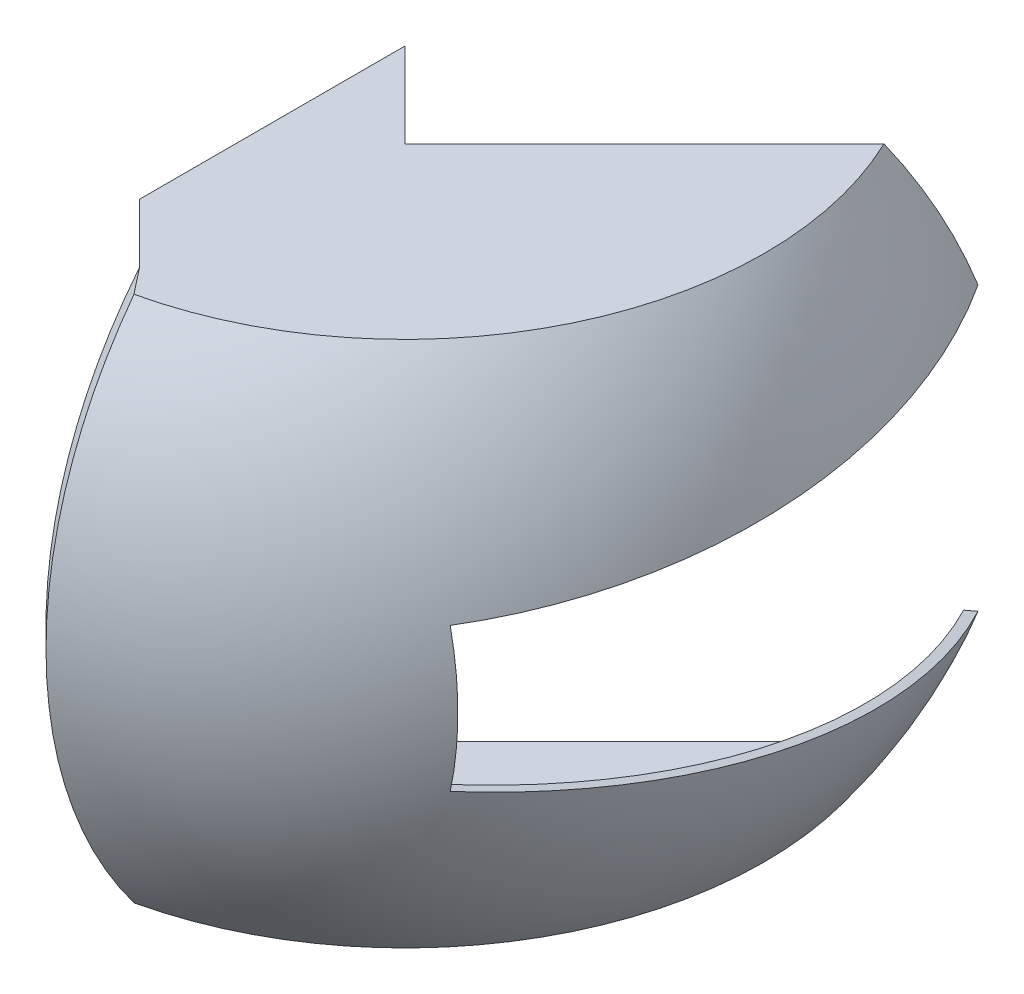
ISO-10303-21;
HEADER;
FILE_DESCRIPTION(('STEP AP214'),'2;1');
FILE_NAME('part.step','',(''),(''),'','','');
FILE_SCHEMA(('AUTOMOTIVE_DESIGN { 1 0 10303 214 1 1 1 1 }'));
ENDSEC;
DATA;
#1=APPLICATION_CONTEXT('core data for automotive mechanical design processes');
#2=APPLICATION_PROTOCOL_DEFINITION('international standard','automotive_design',2000,#1);
#3=PRODUCT_CONTEXT('',#1,'mechanical');
#4=PRODUCT('Part','Part','',(#3));
#5=PRODUCT_RELATED_PRODUCT_CATEGORY('part','',(#4));
#6=PRODUCT_DEFINITION_FORMATION('','',#4);
#7=PRODUCT_DEFINITION_CONTEXT('part definition',#1,'design');
#8=PRODUCT_DEFINITION('design','',#6,#7);
#9=PRODUCT_DEFINITION_SHAPE('','',#8);
#10=(LENGTH_UNIT() NAMED_UNIT(*) SI_UNIT(.MILLI.,.METRE.));
#11=(NAMED_UNIT(*) PLANE_ANGLE_UNIT() SI_UNIT($,.RADIAN.));
#12=(NAMED_UNIT(*) SI_UNIT($,.STERADIAN.) SOLID_ANGLE_UNIT());
#13=UNCERTAINTY_MEASURE_WITH_UNIT(LENGTH_MEASURE(1.E-05),#10,'distance_accuracy_value','');
#14=(GEOMETRIC_REPRESENTATION_CONTEXT(3) GLOBAL_UNCERTAINTY_ASSIGNED_CONTEXT((#13)) GLOBAL_UNIT_ASSIGNED_CONTEXT((#10,
#11,#12)) REPRESENTATION_CONTEXT('',''));
#15=CARTESIAN_POINT('',(0.,0.,0.));
#16=DIRECTION('',(0.,0.,1.));
#17=DIRECTION('',(1.,0.,0.));
#18=AXIS2_PLACEMENT_3D('',#15,#16,#17);
#19=CARTESIAN_POINT('',(12.2872806643349,55.,48.6036465452657));
#20=DIRECTION('',(1.,0.,0.));
#21=DIRECTION('',(0.,0.,-1.));
#22=AXIS2_PLACEMENT_3D('',#19,#20,#21);
#23=PLANE('',#22);
#24=DIRECTION('',(0.,1.,0.));
#25=VECTOR('',#24,1.);
#26=CARTESIAN_POINT('',(12.2872806643349,53.,67.6544254972796));
#27=LINE('',#26,#25);
#28=CARTESIAN_POINT('',(12.2872806643349,53.,67.6544254972796));
#29=VERTEX_POINT('',#28);
#30=CARTESIAN_POINT('',(12.2872806643349,55.,67.6544254972796));
#31=VERTEX_POINT('',#30);
#32=EDGE_CURVE('E61',#29,#31,#27,.T.);
#33=ORIENTED_EDGE('',*,*,#32,.F.);
#34=DIRECTION('',(0.,0.,1.));
#35=VECTOR('',#34,1.);
#36=CARTESIAN_POINT('',(12.2872806643349,53.,48.6036465452657));
#37=LINE('',#36,#35);
#38=CARTESIAN_POINT('',(12.2872806643349,53.,65.6345895867117));
#39=VERTEX_POINT('',#38);
#40=EDGE_CURVE('E181',#39,#29,#37,.T.);
#41=ORIENTED_EDGE('',*,*,#40,.F.);
#42=CARTESIAN_POINT('',(12.2872806643349,0.,0.));
#43=DIRECTION('',(1.,0.,0.));
#44=DIRECTION('',(0.,0.,-1.));
#45=AXIS2_PLACEMENT_3D('',#42,#43,#44);
#46=CIRCLE('',#45,84.3617173261432);
#47=CARTESIAN_POINT('',(12.2872806643349,-53.,65.6345895867118));
#48=VERTEX_POINT('',#47);
#49=EDGE_CURVE('E226',#48,#39,#46,.F.);
#50=ORIENTED_EDGE('',*,*,#49,.F.);
#51=DIRECTION('',(0.,0.,1.));
#52=VECTOR('',#51,1.);
#53=CARTESIAN_POINT('',(12.2872806643349,-53.,48.6036465452657));
#54=LINE('',#53,#52);
#55=CARTESIAN_POINT('',(12.2872806643349,-53.,67.6544254972796));
#56=VERTEX_POINT('',#55);
#57=EDGE_CURVE('E196',#48,#56,#54,.T.);
#58=ORIENTED_EDGE('',*,*,#57,.T.);
#59=DIRECTION('',(0.,-1.,0.));
#60=VECTOR('',#59,1.);
#61=CARTESIAN_POINT('',(12.2872806643349,-53.,67.6544254972796));
#62=LINE('',#61,#60);
#63=CARTESIAN_POINT('',(12.2872806643349,-55.,67.6544254972796));
#64=VERTEX_POINT('',#63);
#65=EDGE_CURVE('E204',#56,#64,#62,.T.);
#66=ORIENTED_EDGE('',*,*,#65,.T.);
#67=CARTESIAN_POINT('',(12.2872806643349,0.,0.));
#68=DIRECTION('',(1.,0.,0.));
#69=DIRECTION('',(0.,0.,-1.));
#70=AXIS2_PLACEMENT_3D('',#67,#68,#69);
#71=CIRCLE('',#70,87.1901444508894);
#72=EDGE_CURVE('E54',#64,#31,#71,.F.);
#73=ORIENTED_EDGE('',*,*,#72,.T.);
#74=EDGE_LOOP('',(#33,#41,#50,#58,#66,#73));
#75=FACE_BOUND('',#74,.T.);
#76=ADVANCED_FACE('F39',(#75),#23,.F.);
#77=CARTESIAN_POINT('',(0.,0.,0.));
#78=DIRECTION('',(-1.,0.,0.));
#79=DIRECTION('',(0.,0.,1.));
#80=AXIS2_PLACEMENT_3D('',#77,#78,#79);
#81=PLANE('',#80);
#82=DIRECTION('',(0.,0.,-1.));
#83=VECTOR('',#82,1.);
#84=CARTESIAN_POINT('',(0.,-55.,0.));
#85=LINE('',#84,#83);
#86=CARTESIAN_POINT('',(0.,-55.,55.3671448329446));
#87=VERTEX_POINT('',#86);
#88=CARTESIAN_POINT('',(0.,-55.,0.));
#89=VERTEX_POINT('',#88);
#90=EDGE_CURVE('E344',#87,#89,#85,.T.);
#91=ORIENTED_EDGE('',*,*,#90,.F.);
#92=DIRECTION('',(0.,-1.,0.));
#93=VECTOR('',#92,1.);
#94=CARTESIAN_POINT('',(0.,-53.,55.3671448329446));
#95=LINE('',#94,#93);
#96=CARTESIAN_POINT('',(0.,-53.,55.3671448329446));
#97=VERTEX_POINT('',#96);
#98=EDGE_CURVE('E208',#97,#87,#95,.T.);
#99=ORIENTED_EDGE('',*,*,#98,.F.);
#100=DIRECTION('',(0.,0.,-1.));
#101=VECTOR('',#100,1.);
#102=CARTESIAN_POINT('',(0.,-53.,0.));
#103=LINE('',#102,#101);
#104=CARTESIAN_POINT('',(0.,-53.,0.));
#105=VERTEX_POINT('',#104);
#106=EDGE_CURVE('E174',#97,#105,#103,.T.);
#107=ORIENTED_EDGE('',*,*,#106,.T.);
#108=DIRECTION('',(0.,-1.,0.));
#109=VECTOR('',#108,1.);
#110=CARTESIAN_POINT('',(0.,55.,0.));
#111=LINE('',#110,#109);
#112=EDGE_CURVE('E322',#105,#89,#111,.T.);
#113=ORIENTED_EDGE('',*,*,#112,.T.);
#114=EDGE_LOOP('',(#91,#99,#107,#113));
#115=FACE_BOUND('',#114,.T.);
#116=ADVANCED_FACE('F385',(#115),#81,.T.);
#117=CARTESIAN_POINT('',(0.,55.,0.));
#118=DIRECTION('',(-0.707106781186547,0.,0.707106781186547));
#119=DIRECTION('',(0.707106781186548,0.,0.707106781186548));
#120=AXIS2_PLACEMENT_3D('',#117,#118,#119);
#121=PLANE('',#120);
#122=DIRECTION('',(-0.707106781186548,0.,-0.707106781186548));
#123=VECTOR('',#122,1.);
#124=CARTESIAN_POINT('',(0.,-53.,0.));
#125=LINE('',#124,#123);
#126=CARTESIAN_POINT('',(17.6776695296637,-53.,17.6776695296637));
#127=VERTEX_POINT('',#126);
#128=EDGE_CURVE('E272',#127,#105,#125,.T.);
#129=ORIENTED_EDGE('',*,*,#128,.F.);
#130=DIRECTION('',(0.,-1.,0.));
#131=VECTOR('',#130,1.);
#132=CARTESIAN_POINT('',(17.6776695296637,55.,17.6776695296637));
#133=LINE('',#132,#131);
#134=CARTESIAN_POINT('',(17.6776695296637,-55.,17.6776695296637));
#135=VERTEX_POINT('',#134);
#136=EDGE_CURVE('E334',#127,#135,#133,.T.);
#137=ORIENTED_EDGE('',*,*,#136,.T.);
#138=DIRECTION('',(-0.707106781186547,0.,-0.707106781186547));
#139=VECTOR('',#138,1.);
#140=CARTESIAN_POINT('',(0.,-55.,0.));
#141=LINE('',#140,#139);
#142=EDGE_CURVE('E312',#135,#89,#141,.T.);
#143=ORIENTED_EDGE('',*,*,#142,.T.);
#144=ORIENTED_EDGE('',*,*,#112,.F.);
#145=EDGE_LOOP('',(#129,#137,#143,#144));
#146=FACE_BOUND('',#145,.T.);
#147=ADVANCED_FACE('F390',(#146),#121,.F.);
#148=DIRECTION('',(0.,0.,-1.));
#149=VECTOR('',#148,1.);
#150=CARTESIAN_POINT('',(0.,53.,0.));
#151=LINE('',#150,#149);
#152=CARTESIAN_POINT('',(0.,53.,55.3671448329446));
#153=VERTEX_POINT('',#152);
#154=CARTESIAN_POINT('',(0.,53.,0.));
#155=VERTEX_POINT('',#154);
#156=EDGE_CURVE('E164',#153,#155,#151,.T.);
#157=ORIENTED_EDGE('',*,*,#156,.F.);
#158=DIRECTION('',(0.,1.,0.));
#159=VECTOR('',#158,1.);
#160=CARTESIAN_POINT('',(0.,53.,55.3671448329446));
#161=LINE('',#160,#159);
#162=CARTESIAN_POINT('',(0.,55.,55.3671448329446));
#163=VERTEX_POINT('',#162);
#164=EDGE_CURVE('E169',#153,#163,#161,.T.);
#165=ORIENTED_EDGE('',*,*,#164,.T.);
#166=DIRECTION('',(0.,0.,-1.));
#167=VECTOR('',#166,1.);
#168=CARTESIAN_POINT('',(0.,55.,0.));
#169=LINE('',#168,#167);
#170=CARTESIAN_POINT('',(0.,55.,0.));
#171=VERTEX_POINT('',#170);
#172=EDGE_CURVE('E341',#163,#171,#169,.T.);
#173=ORIENTED_EDGE('',*,*,#172,.T.);
#174=EDGE_CURVE('E170',#171,#155,#111,.T.);
#175=ORIENTED_EDGE('',*,*,#174,.T.);
#176=EDGE_LOOP('',(#157,#165,#173,#175));
#177=FACE_BOUND('',#176,.T.);
#178=ADVANCED_FACE('F166',(#177),#81,.T.);
#179=CARTESIAN_POINT('',(17.6776695296637,55.,17.6776695296637));
#180=DIRECTION('',(0.707106781186548,0.,0.707106781186548));
#181=DIRECTION('',(0.707106781186548,0.,-0.707106781186548));
#182=AXIS2_PLACEMENT_3D('',#179,#180,#181);
#183=PLANE('',#182);
#184=DIRECTION('',(-0.703571165799069,-0.0998760697678762,0.703571165799069));
#185=VECTOR('',#184,1.);
#186=CARTESIAN_POINT('',(20.0662914918726,21.3469829657806,15.2890475674547));
#187=LINE('',#186,#185);
#188=CARTESIAN_POINT('',(77.4891998766671,29.4985029297923,-42.1338608173398));
#189=VERTEX_POINT('',#188);
#190=CARTESIAN_POINT('',(75.9845002304108,29.2849019550017,-40.6291611710834));
#191=VERTEX_POINT('',#190);
#192=EDGE_CURVE('E300',#189,#191,#187,.T.);
#193=ORIENTED_EDGE('',*,*,#192,.T.);
#194=CARTESIAN_POINT('',(17.6776695296637,0.,17.6776695296637));
#195=DIRECTION('',(0.707106781186548,0.,0.707106781186548));
#196=DIRECTION('',(0.707106781186548,0.,-0.707106781186548));
#197=AXIS2_PLACEMENT_3D('',#194,#195,#196);
#198=CIRCLE('',#197,87.5041627309537);
#199=CARTESIAN_POINT('',(66.9116948335388,53.,-31.5563557742114));
#200=VERTEX_POINT('',#199);
#201=EDGE_CURVE('E262',#191,#200,#198,.T.);
#202=ORIENTED_EDGE('',*,*,#201,.T.);
#203=DIRECTION('',(-0.707106781186548,0.,0.707106781186548));
#204=VECTOR('',#203,1.);
#205=CARTESIAN_POINT('',(17.6776695296637,53.,17.6776695296637));
#206=LINE('',#205,#204);
#207=CARTESIAN_POINT('',(17.6776695296637,53.,17.6776695296637));
#208=VERTEX_POINT('',#207);
#209=EDGE_CURVE('E257',#200,#208,#206,.T.);
#210=ORIENTED_EDGE('',*,*,#209,.T.);
#211=CARTESIAN_POINT('',(17.6776695296637,55.,17.6776695296637));
#212=VERTEX_POINT('',#211);
#213=EDGE_CURVE('E329',#212,#208,#133,.T.);
#214=ORIENTED_EDGE('',*,*,#213,.F.);
#215=DIRECTION('',(-0.707106781186548,0.,0.707106781186548));
#216=VECTOR('',#215,1.);
#217=CARTESIAN_POINT('',(17.6776695296637,55.,17.6776695296637));
#218=LINE('',#217,#216);
#219=CARTESIAN_POINT('',(67.6776695296637,55.,-32.3223304703363));
#220=VERTEX_POINT('',#219);
#221=EDGE_CURVE('E317',#220,#212,#218,.T.);
#222=ORIENTED_EDGE('',*,*,#221,.F.);
#223=CARTESIAN_POINT('',(17.6776695296637,0.,17.6776695296637));
#224=DIRECTION('',(0.707106781186548,0.,0.707106781186548));
#225=DIRECTION('',(0.707106781186548,0.,-0.707106781186548));
#226=AXIS2_PLACEMENT_3D('',#223,#224,#225);
#227=CIRCLE('',#226,89.5823643358446);
#228=EDGE_CURVE('E333',#189,#220,#227,.T.);
#229=ORIENTED_EDGE('',*,*,#228,.F.);
#230=EDGE_LOOP('',(#193,#202,#210,#214,#222,#229));
#231=FACE_BOUND('',#230,.T.);
#232=ADVANCED_FACE('F400',(#231),#183,.F.);
#233=ORIENTED_EDGE('',*,*,#213,.T.);
#234=DIRECTION('',(-0.707106781186548,0.,-0.707106781186548));
#235=VECTOR('',#234,1.);
#236=CARTESIAN_POINT('',(0.,53.,0.));
#237=LINE('',#236,#235);
#238=EDGE_CURVE('E254',#208,#155,#237,.T.);
#239=ORIENTED_EDGE('',*,*,#238,.T.);
#240=ORIENTED_EDGE('',*,*,#174,.F.);
#241=DIRECTION('',(-0.707106781186547,0.,-0.707106781186547));
#242=VECTOR('',#241,1.);
#243=CARTESIAN_POINT('',(0.,55.,0.));
#244=LINE('',#243,#242);
#245=EDGE_CURVE('E313',#212,#171,#244,.T.);
#246=ORIENTED_EDGE('',*,*,#245,.F.);
#247=EDGE_LOOP('',(#233,#239,#240,#246));
#248=FACE_BOUND('',#247,.T.);
#249=ADVANCED_FACE('F382',(#248),#121,.F.);
#250=CARTESIAN_POINT('',(0.,55.,0.));
#251=DIRECTION('',(0.,-1.,0.));
#252=DIRECTION('',(0.,0.,-1.));
#253=AXIS2_PLACEMENT_3D('',#250,#251,#252);
#254=PLANE('',#253);
#255=DIRECTION('',(-0.707106781186544,0.,-0.707106781186551));
#256=VECTOR('',#255,1.);
#257=CARTESIAN_POINT('',(12.2872806643349,55.,67.6544254972796));
#258=LINE('',#257,#256);
#259=EDGE_CURVE('E188',#31,#163,#258,.T.);
#260=ORIENTED_EDGE('',*,*,#259,.F.);
#261=CARTESIAN_POINT('',(12.2872806643349,55.,67.6544254972796));
#262=CARTESIAN_POINT('',(12.6439303032145,55.,68.1140587831876));
#263=CARTESIAN_POINT('',(13.0014808741294,55.,68.5729925023131));
#264=CARTESIAN_POINT('',(13.7182975260488,55.,69.4895087756792));
#265=CARTESIAN_POINT('',(14.077563584871,55.,69.9470913472678));
#266=CARTESIAN_POINT('',(14.7977337330616,55.,70.8609647294817));
#267=CARTESIAN_POINT('',(15.158637820936,55.,71.3172555412845));
#268=CARTESIAN_POINT('',(15.8820145741686,55.,72.2286017574101));
#269=CARTESIAN_POINT('',(16.2444872596942,55.,72.683657145726));
#270=CARTESIAN_POINT('',(16.6077046993767,55.,73.1381169064278));
#271=B_SPLINE_CURVE_WITH_KNOTS('',3,(#261,#262,#263,#264,#265,#266,#267,#268,#269,#270),
.UNSPECIFIED.,.F.,.F.,(4,2,2,2,4),(0.,1.74532221552484,3.49062192368656,5.23592004032604,
6.98124066332975),.UNSPECIFIED.);
#272=CARTESIAN_POINT('',(16.6077046993767,55.,73.1381169064278));
#273=VERTEX_POINT('',#272);
#274=EDGE_CURVE('E11',#31,#273,#271,.T.);
#275=ORIENTED_EDGE('',*,*,#274,.T.);
#276=CARTESIAN_POINT('',(0.,55.,0.));
#277=DIRECTION('',(0.,-1.,0.));
#278=DIRECTION('',(0.,0.,-1.));
#279=AXIS2_PLACEMENT_3D('',#276,#277,#278);
#280=CIRCLE('',#279,75.);
#281=EDGE_CURVE('E352',#220,#273,#280,.T.);
#282=ORIENTED_EDGE('',*,*,#281,.F.);
#283=ORIENTED_EDGE('',*,*,#221,.T.);
#284=ORIENTED_EDGE('',*,*,#245,.T.);
#285=ORIENTED_EDGE('',*,*,#172,.F.);
#286=EDGE_LOOP('',(#260,#275,#282,#283,#284,#285));
#287=FACE_BOUND('',#286,.T.);
#288=ADVANCED_FACE('F374',(#287),#254,.F.);
#289=CARTESIAN_POINT('',(0.,0.,0.));
#290=DIRECTION('',(0.,-1.,0.));
#291=DIRECTION('',(0.,0.,-1.));
#292=AXIS2_PLACEMENT_3D('',#289,#290,#291);
#293=SPHERICAL_SURFACE('',#292,93.0053761886914);
#294=ORIENTED_EDGE('',*,*,#281,.T.);
#295=CARTESIAN_POINT('',(16.6077046993767,0.,0.));
#296=DIRECTION('',(-1.,0.,0.));
#297=DIRECTION('',(0.,0.,1.));
#298=AXIS2_PLACEMENT_3D('',#295,#296,#297);
#299=CIRCLE('',#298,91.5105684859312);
#300=CARTESIAN_POINT('',(16.6077046993767,-55.,73.1381169064278));
#301=VERTEX_POINT('',#300);
#302=EDGE_CURVE('E356',#273,#301,#299,.F.);
#303=ORIENTED_EDGE('',*,*,#302,.T.);
#304=CARTESIAN_POINT('',(0.,-55.,0.));
#305=DIRECTION('',(0.,-1.,0.));
#306=DIRECTION('',(0.,0.,-1.));
#307=AXIS2_PLACEMENT_3D('',#304,#305,#306);
#308=CIRCLE('',#307,75.);
#309=CARTESIAN_POINT('',(67.6776695296637,-55.,-32.3223304703363));
#310=VERTEX_POINT('',#309);
#311=EDGE_CURVE('E348',#310,#301,#308,.T.);
#312=ORIENTED_EDGE('',*,*,#311,.F.);
#313=CARTESIAN_POINT('',(77.4891998766672,-29.4985029297923,-42.1338608173398));
#314=VERTEX_POINT('',#313);
#315=EDGE_CURVE('E337',#310,#314,#227,.T.);
#316=ORIENTED_EDGE('',*,*,#315,.T.);
#317=CARTESIAN_POINT('',(0.,-23.0528052823745,3.27248144985129));
#318=DIRECTION('',(0.,-0.990074030670294,0.140546838428607));
#319=DIRECTION('',(0.,-0.140546838428607,-0.990074030670294));
#320=AXIS2_PLACEMENT_3D('',#317,#318,#319);
#321=CIRCLE('',#320,90.0436507132696);
#322=CARTESIAN_POINT('',(69.462219947249,-15.,60.));
#323=VERTEX_POINT('',#322);
#324=EDGE_CURVE('E296',#314,#323,#321,.T.);
#325=ORIENTED_EDGE('',*,*,#324,.T.);
#326=CARTESIAN_POINT('',(0.,0.,60.));
#327=DIRECTION('',(0.,0.,1.));
#328=DIRECTION('',(1.,0.,0.));
#329=AXIS2_PLACEMENT_3D('',#326,#327,#328);
#330=CIRCLE('',#329,71.0633520177595);
#331=CARTESIAN_POINT('',(69.462219947249,15.,60.));
#332=VERTEX_POINT('',#331);
#333=EDGE_CURVE('E308',#323,#332,#330,.T.);
#334=ORIENTED_EDGE('',*,*,#333,.T.);
#335=CARTESIAN_POINT('',(0.,23.0528052823745,3.27248144985129));
#336=DIRECTION('',(0.,0.990074030670294,0.140546838428607));
#337=DIRECTION('',(0.,-0.140546838428607,0.990074030670294));
#338=AXIS2_PLACEMENT_3D('',#335,#336,#337);
#339=CIRCLE('',#338,90.0436507132696);
#340=EDGE_CURVE('E304',#332,#189,#339,.T.);
#341=ORIENTED_EDGE('',*,*,#340,.T.);
#342=ORIENTED_EDGE('',*,*,#228,.T.);
#343=EDGE_LOOP('',(#294,#303,#312,#316,#325,#334,#341,#342));
#344=FACE_BOUND('',#343,.T.);
#345=ADVANCED_FACE('F372',(#344),#293,.T.);
#346=CARTESIAN_POINT('',(0.,-55.,0.));
#347=DIRECTION('',(0.,-1.,0.));
#348=DIRECTION('',(0.,0.,-1.));
#349=AXIS2_PLACEMENT_3D('',#346,#347,#348);
#350=PLANE('',#349);
#351=CARTESIAN_POINT('',(16.6077046993767,-55.,73.1381169064278));
#352=CARTESIAN_POINT('',(16.2444872596942,-55.,72.683657145726));
#353=CARTESIAN_POINT('',(15.8820145741686,-55.,72.2286017574101));
#354=CARTESIAN_POINT('',(15.158637820936,-55.,71.3172555412845));
#355=CARTESIAN_POINT('',(14.7977337330615,-55.,70.8609647294816));
#356=CARTESIAN_POINT('',(14.077563584871,-55.,69.9470913472678));
#357=CARTESIAN_POINT('',(13.7182975260488,-55.,69.4895087756791));
#358=CARTESIAN_POINT('',(13.0014808741294,-55.,68.5729925023131));
#359=CARTESIAN_POINT('',(12.6439303032145,-55.,68.1140587831876));
#360=CARTESIAN_POINT('',(12.2872806643349,-55.,67.6544254972796));
#361=B_SPLINE_CURVE_WITH_KNOTS('',3,(#351,#352,#353,#354,#355,#356,#357,#358,#359,#360),
.UNSPECIFIED.,.F.,.F.,(4,2,2,2,4),(0.,1.74532062300368,3.4906187396432,5.2359184478049,
6.98124066332975),.UNSPECIFIED.);
#362=EDGE_CURVE('E360',#301,#64,#361,.T.);
#363=ORIENTED_EDGE('',*,*,#362,.T.);
#364=DIRECTION('',(-0.707106781186544,0.,-0.707106781186551));
#365=VECTOR('',#364,1.);
#366=CARTESIAN_POINT('',(12.2872806643349,-55.,67.6544254972796));
#367=LINE('',#366,#365);
#368=EDGE_CURVE('E192',#64,#87,#367,.T.);
#369=ORIENTED_EDGE('',*,*,#368,.T.);
#370=ORIENTED_EDGE('',*,*,#90,.T.);
#371=ORIENTED_EDGE('',*,*,#142,.F.);
#372=DIRECTION('',(-0.707106781186548,0.,0.707106781186548));
#373=VECTOR('',#372,1.);
#374=CARTESIAN_POINT('',(17.6776695296637,-55.,17.6776695296637));
#375=LINE('',#374,#373);
#376=EDGE_CURVE('E318',#310,#135,#375,.T.);
#377=ORIENTED_EDGE('',*,*,#376,.F.);
#378=ORIENTED_EDGE('',*,*,#311,.T.);
#379=EDGE_LOOP('',(#363,#369,#370,#371,#377,#378));
#380=FACE_BOUND('',#379,.T.);
#381=ADVANCED_FACE('F368',(#380),#350,.T.);
#382=DIRECTION('',(-0.707106781186548,0.,0.707106781186548));
#383=VECTOR('',#382,1.);
#384=CARTESIAN_POINT('',(17.6776695296637,-53.,17.6776695296637));
#385=LINE('',#384,#383);
#386=CARTESIAN_POINT('',(66.9116948335388,-53.,-31.5563557742114));
#387=VERTEX_POINT('',#386);
#388=EDGE_CURVE('E258',#387,#127,#385,.T.);
#389=ORIENTED_EDGE('',*,*,#388,.F.);
#390=CARTESIAN_POINT('',(17.6776695296637,0.,17.6776695296637));
#391=DIRECTION('',(0.707106781186548,0.,0.707106781186548));
#392=DIRECTION('',(0.707106781186548,0.,-0.707106781186548));
#393=AXIS2_PLACEMENT_3D('',#390,#391,#392);
#394=CIRCLE('',#393,87.5041627309537);
#395=CARTESIAN_POINT('',(75.9845002304108,-29.2849019550017,-40.6291611710834));
#396=VERTEX_POINT('',#395);
#397=EDGE_CURVE('E175',#387,#396,#394,.T.);
#398=ORIENTED_EDGE('',*,*,#397,.T.);
#399=DIRECTION('',(0.703571165799069,-0.099876069767876,-0.703571165799069));
#400=VECTOR('',#399,1.);
#401=CARTESIAN_POINT('',(12.3365999792511,-20.24970774143,23.0187390800762));
#402=LINE('',#401,#400);
#403=EDGE_CURVE('E291',#396,#314,#402,.T.);
#404=ORIENTED_EDGE('',*,*,#403,.T.);
#405=ORIENTED_EDGE('',*,*,#315,.F.);
#406=ORIENTED_EDGE('',*,*,#376,.T.);
#407=ORIENTED_EDGE('',*,*,#136,.F.);
#408=EDGE_LOOP('',(#389,#398,#404,#405,#406,#407));
#409=FACE_BOUND('',#408,.T.);
#410=ADVANCED_FACE('F371',(#409),#183,.F.);
#411=CARTESIAN_POINT('',(0.,-15.,60.));
#412=DIRECTION('',(0.,0.,1.));
#413=DIRECTION('',(1.,0.,0.));
#414=AXIS2_PLACEMENT_3D('',#411,#412,#413);
#415=PLANE('',#414);
#416=DIRECTION('',(1.,0.,0.));
#417=VECTOR('',#416,1.);
#418=CARTESIAN_POINT('',(0.,-15.,60.));
#419=LINE('',#418,#417);
#420=CARTESIAN_POINT('',(66.7606058633775,-15.,60.));
#421=VERTEX_POINT('',#420);
#422=EDGE_CURVE('E288',#421,#323,#419,.T.);
#423=ORIENTED_EDGE('',*,*,#422,.F.);
#424=CARTESIAN_POINT('',(0.,0.,60.));
#425=DIRECTION('',(0.,0.,1.));
#426=DIRECTION('',(1.,0.,0.));
#427=AXIS2_PLACEMENT_3D('',#424,#425,#426);
#428=CIRCLE('',#427,68.4249844373036);
#429=CARTESIAN_POINT('',(66.7606058633775,15.,60.));
#430=VERTEX_POINT('',#429);
#431=EDGE_CURVE('E69',#421,#430,#428,.T.);
#432=ORIENTED_EDGE('',*,*,#431,.T.);
#433=DIRECTION('',(1.,0.,0.));
#434=VECTOR('',#433,1.);
#435=CARTESIAN_POINT('',(0.,15.,60.));
#436=LINE('',#435,#434);
#437=EDGE_CURVE('E225',#430,#332,#436,.T.);
#438=ORIENTED_EDGE('',*,*,#437,.T.);
#439=ORIENTED_EDGE('',*,*,#333,.F.);
#440=EDGE_LOOP('',(#423,#432,#438,#439));
#441=FACE_BOUND('',#440,.T.);
#442=ADVANCED_FACE('F539',(#441),#415,.F.);
#443=CARTESIAN_POINT('',(0.,30.0000000000009,-45.6666277669359));
#444=DIRECTION('',(0.,0.990074030670294,0.140546838428607));
#445=DIRECTION('',(0.,-0.140546838428607,0.990074030670294));
#446=AXIS2_PLACEMENT_3D('',#443,#444,#445);
#447=PLANE('',#446);
#448=ORIENTED_EDGE('',*,*,#437,.F.);
#449=CARTESIAN_POINT('',(0.,23.0528052823745,3.27248144985129));
#450=DIRECTION('',(0.,0.990074030670294,0.140546838428607));
#451=DIRECTION('',(0.,-0.140546838428607,0.990074030670294));
#452=AXIS2_PLACEMENT_3D('',#449,#450,#451);
#453=CIRCLE('',#452,87.9763464177647);
#454=EDGE_CURVE('E266',#430,#191,#453,.T.);
#455=ORIENTED_EDGE('',*,*,#454,.T.);
#456=ORIENTED_EDGE('',*,*,#192,.F.);
#457=ORIENTED_EDGE('',*,*,#340,.F.);
#458=EDGE_LOOP('',(#448,#455,#456,#457));
#459=FACE_BOUND('',#458,.T.);
#460=ADVANCED_FACE('F530',(#459),#447,.F.);
#461=CARTESIAN_POINT('',(0.,-30.0000000000009,-45.666627766936));
#462=DIRECTION('',(0.,-0.990074030670294,0.140546838428607));
#463=DIRECTION('',(0.,-0.140546838428607,-0.990074030670294));
#464=AXIS2_PLACEMENT_3D('',#461,#462,#463);
#465=PLANE('',#464);
#466=ORIENTED_EDGE('',*,*,#403,.F.);
#467=CARTESIAN_POINT('',(0.,-23.0528052823745,3.27248144985129));
#468=DIRECTION('',(0.,-0.990074030670294,0.140546838428607));
#469=DIRECTION('',(0.,-0.140546838428607,-0.990074030670294));
#470=AXIS2_PLACEMENT_3D('',#467,#468,#469);
#471=CIRCLE('',#470,87.9763464177647);
#472=EDGE_CURVE('E212',#396,#421,#471,.T.);
#473=ORIENTED_EDGE('',*,*,#472,.T.);
#474=ORIENTED_EDGE('',*,*,#422,.T.);
#475=ORIENTED_EDGE('',*,*,#324,.F.);
#476=EDGE_LOOP('',(#466,#473,#474,#475));
#477=FACE_BOUND('',#476,.T.);
#478=ADVANCED_FACE('F473',(#477),#465,.F.);
#479=CARTESIAN_POINT('',(16.6077046993767,0.,0.));
#480=DIRECTION('',(1.,0.,0.));
#481=DIRECTION('',(0.,0.,-1.));
#482=AXIS2_PLACEMENT_3D('',#479,#480,#481);
#483=CONICAL_SURFACE('',#482,91.5105684859312,0.78539816339745);
#484=ORIENTED_EDGE('',*,*,#274,.F.);
#485=ORIENTED_EDGE('',*,*,#72,.F.);
#486=ORIENTED_EDGE('',*,*,#362,.F.);
#487=ORIENTED_EDGE('',*,*,#302,.F.);
#488=EDGE_LOOP('',(#484,#485,#486,#487));
#489=FACE_BOUND('',#488,.T.);
#490=ADVANCED_FACE('F41',(#489),#483,.T.);
#491=CARTESIAN_POINT('',(0.,53.,0.));
#492=DIRECTION('',(0.,-1.,0.));
#493=DIRECTION('',(0.,0.,-1.));
#494=AXIS2_PLACEMENT_3D('',#491,#492,#493);
#495=PLANE('',#494);
#496=CARTESIAN_POINT('',(12.2872806643349,53.,65.6345895867117));
#497=CARTESIAN_POINT('',(12.6984875961874,53.,66.1631207393059));
#498=CARTESIAN_POINT('',(13.1109123609086,53.,66.690703475753));
#499=CARTESIAN_POINT('',(13.9380609308469,53.,67.7440490466757));
#500=CARTESIAN_POINT('',(14.352784696236,53.,68.2698119124243));
#501=CARTESIAN_POINT('',(15.1844082521366,53.,69.3196121616587));
#502=CARTESIAN_POINT('',(15.6013080394951,53.,69.8436495476432));
#503=CARTESIAN_POINT('',(16.4371755257092,53.,70.8900874435007));
#504=CARTESIAN_POINT('',(16.8561432601518,53.,71.4124879249497));
#505=CARTESIAN_POINT('',(17.276083410719,53.,71.9341048267865));
#506=B_SPLINE_CURVE_WITH_KNOTS('',3,(#496,#497,#498,#499,#500,#501,#502,#503,#504,#505),
.UNSPECIFIED.,.F.,.F.,(4,2,2,2,4),(0.,2.00895881775448,4.01788294028224,6.02680415255396,
8.0357600574961),.UNSPECIFIED.);
#507=CARTESIAN_POINT('',(17.276083410719,53.,71.9341048267865));
#508=VERTEX_POINT('',#507);
#509=EDGE_CURVE('E216',#39,#508,#506,.T.);
#510=ORIENTED_EDGE('',*,*,#509,.F.);
#511=ORIENTED_EDGE('',*,*,#40,.T.);
#512=DIRECTION('',(-0.707106781186544,0.,-0.707106781186551));
#513=VECTOR('',#512,1.);
#514=CARTESIAN_POINT('',(12.2872806643349,53.,67.6544254972796));
#515=LINE('',#514,#513);
#516=EDGE_CURVE('E178',#29,#153,#515,.T.);
#517=ORIENTED_EDGE('',*,*,#516,.T.);
#518=ORIENTED_EDGE('',*,*,#156,.T.);
#519=ORIENTED_EDGE('',*,*,#238,.F.);
#520=ORIENTED_EDGE('',*,*,#209,.F.);
#521=CARTESIAN_POINT('',(0.,53.,0.));
#522=DIRECTION('',(0.,-1.,0.));
#523=DIRECTION('',(0.,0.,-1.));
#524=AXIS2_PLACEMENT_3D('',#521,#522,#523);
#525=CIRCLE('',#524,73.9795816103689);
#526=EDGE_CURVE('E227',#200,#508,#525,.T.);
#527=ORIENTED_EDGE('',*,*,#526,.T.);
#528=EDGE_LOOP('',(#510,#511,#517,#518,#519,#520,#527));
#529=FACE_BOUND('',#528,.T.);
#530=ADVANCED_FACE('F180',(#529),#495,.T.);
#531=CARTESIAN_POINT('',(0.,0.,0.));
#532=DIRECTION('',(0.,-1.,0.));
#533=DIRECTION('',(0.,0.,-1.));
#534=AXIS2_PLACEMENT_3D('',#531,#532,#533);
#535=SPHERICAL_SURFACE('',#534,91.0053761886914);
#536=ORIENTED_EDGE('',*,*,#526,.F.);
#537=ORIENTED_EDGE('',*,*,#201,.F.);
#538=ORIENTED_EDGE('',*,*,#454,.F.);
#539=ORIENTED_EDGE('',*,*,#431,.F.);
#540=ORIENTED_EDGE('',*,*,#472,.F.);
#541=ORIENTED_EDGE('',*,*,#397,.F.);
#542=CARTESIAN_POINT('',(0.,-53.,0.));
#543=DIRECTION('',(0.,-1.,0.));
#544=DIRECTION('',(0.,0.,-1.));
#545=AXIS2_PLACEMENT_3D('',#542,#543,#544);
#546=CIRCLE('',#545,73.9795816103689);
#547=CARTESIAN_POINT('',(17.276083410719,-53.,71.9341048267865));
#548=VERTEX_POINT('',#547);
#549=EDGE_CURVE('E252',#387,#548,#546,.T.);
#550=ORIENTED_EDGE('',*,*,#549,.T.);
#551=CARTESIAN_POINT('',(17.276083410719,0.,0.));
#552=DIRECTION('',(1.,0.,0.));
#553=DIRECTION('',(0.,0.,-1.));
#554=AXIS2_PLACEMENT_3D('',#551,#552,#553);
#555=CIRCLE('',#554,89.3505200725273);
#556=EDGE_CURVE('E251',#508,#548,#555,.T.);
#557=ORIENTED_EDGE('',*,*,#556,.F.);
#558=EDGE_LOOP('',(#536,#537,#538,#539,#540,#541,#550,#557));
#559=FACE_BOUND('',#558,.T.);
#560=ADVANCED_FACE('F235',(#559),#535,.F.);
#561=CARTESIAN_POINT('',(0.,-53.,0.));
#562=DIRECTION('',(0.,-1.,0.));
#563=DIRECTION('',(0.,0.,-1.));
#564=AXIS2_PLACEMENT_3D('',#561,#562,#563);
#565=PLANE('',#564);
#566=ORIENTED_EDGE('',*,*,#57,.F.);
#567=CARTESIAN_POINT('',(17.276083410719,-53.,71.9341048267865));
#568=CARTESIAN_POINT('',(16.8561432601518,-53.,71.4124879249497));
#569=CARTESIAN_POINT('',(16.4371755257092,-53.,70.8900874435007));
#570=CARTESIAN_POINT('',(15.6013080394951,-53.,69.8436495476432));
#571=CARTESIAN_POINT('',(15.1844082521366,-53.,69.3196121616587));
#572=CARTESIAN_POINT('',(14.3527846962359,-53.,68.2698119124243));
#573=CARTESIAN_POINT('',(13.9380609308469,-53.,67.7440490466757));
#574=CARTESIAN_POINT('',(13.1109123609086,-53.,66.690703475753));
#575=CARTESIAN_POINT('',(12.6984875961874,-53.,66.1631207393059));
#576=CARTESIAN_POINT('',(12.2872806643349,-53.,65.6345895867117));
#577=B_SPLINE_CURVE_WITH_KNOTS('',3,(#567,#568,#569,#570,#571,#572,#573,#574,#575,#576),
.UNSPECIFIED.,.F.,.F.,(4,2,2,2,4),(0.,2.00895590494216,4.01787711721386,6.02680123974163,
8.03576005749611),.UNSPECIFIED.);
#578=EDGE_CURVE('E243',#548,#48,#577,.T.);
#579=ORIENTED_EDGE('',*,*,#578,.F.);
#580=ORIENTED_EDGE('',*,*,#549,.F.);
#581=ORIENTED_EDGE('',*,*,#388,.T.);
#582=ORIENTED_EDGE('',*,*,#128,.T.);
#583=ORIENTED_EDGE('',*,*,#106,.F.);
#584=DIRECTION('',(-0.707106781186544,0.,-0.707106781186551));
#585=VECTOR('',#584,1.);
#586=CARTESIAN_POINT('',(12.2872806643349,-53.,67.6544254972796));
#587=LINE('',#586,#585);
#588=EDGE_CURVE('E200',#56,#97,#587,.T.);
#589=ORIENTED_EDGE('',*,*,#588,.F.);
#590=EDGE_LOOP('',(#566,#579,#580,#581,#582,#583,#589));
#591=FACE_BOUND('',#590,.T.);
#592=ADVANCED_FACE('F236',(#591),#565,.F.);
#593=CARTESIAN_POINT('',(18.0219182617498,0.,0.));
#594=DIRECTION('',(1.,0.,0.));
#595=DIRECTION('',(0.,0.,-1.));
#596=AXIS2_PLACEMENT_3D('',#593,#594,#595);
#597=CONICAL_SURFACE('',#596,90.0963549235581,0.78539816339745);
#598=ORIENTED_EDGE('',*,*,#509,.T.);
#599=ORIENTED_EDGE('',*,*,#556,.T.);
#600=ORIENTED_EDGE('',*,*,#578,.T.);
#601=ORIENTED_EDGE('',*,*,#49,.T.);
#602=EDGE_LOOP('',(#598,#599,#600,#601));
#603=FACE_BOUND('',#602,.T.);
#604=ADVANCED_FACE('F229',(#603),#597,.F.);
#605=CARTESIAN_POINT('',(12.2872806643349,-53.,67.6544254972796));
#606=DIRECTION('',(-0.707106781186552,0.,0.707106781186544));
#607=DIRECTION('',(0.707106781186544,0.,0.707106781186552));
#608=AXIS2_PLACEMENT_3D('',#605,#606,#607);
#609=PLANE('',#608);
#610=ORIENTED_EDGE('',*,*,#368,.F.);
#611=ORIENTED_EDGE('',*,*,#65,.F.);
#612=ORIENTED_EDGE('',*,*,#588,.T.);
#613=ORIENTED_EDGE('',*,*,#98,.T.);
#614=EDGE_LOOP('',(#610,#611,#612,#613));
#615=FACE_BOUND('',#614,.T.);
#616=ADVANCED_FACE('F434',(#615),#609,.T.);
#617=CARTESIAN_POINT('',(12.2872806643349,53.,67.6544254972796));
#618=DIRECTION('',(0.707106781186552,0.,-0.707106781186544));
#619=DIRECTION('',(-0.707106781186544,0.,-0.707106781186552));
#620=AXIS2_PLACEMENT_3D('',#617,#618,#619);
#621=PLANE('',#620);
#622=ORIENTED_EDGE('',*,*,#259,.T.);
#623=ORIENTED_EDGE('',*,*,#164,.F.);
#624=ORIENTED_EDGE('',*,*,#516,.F.);
#625=ORIENTED_EDGE('',*,*,#32,.T.);
#626=EDGE_LOOP('',(#622,#623,#624,#625));
#627=FACE_BOUND('',#626,.T.);
#628=ADVANCED_FACE('F186',(#627),#621,.F.);
#629=CLOSED_SHELL('',(#76,#116,#147,#178,#232,#249,#288,#345,#381,#410,#442,#460,#478,#490,#530,
#560,#592,#604,#616,#628));
#630=MANIFOLD_SOLID_BREP('B2',#629);
#631=ADVANCED_BREP_SHAPE_REPRESENTATION('',(#18,#630),#14);
#632=SHAPE_DEFINITION_REPRESENTATION(#9,#631);
ENDSEC;
END-ISO-10303-21;
